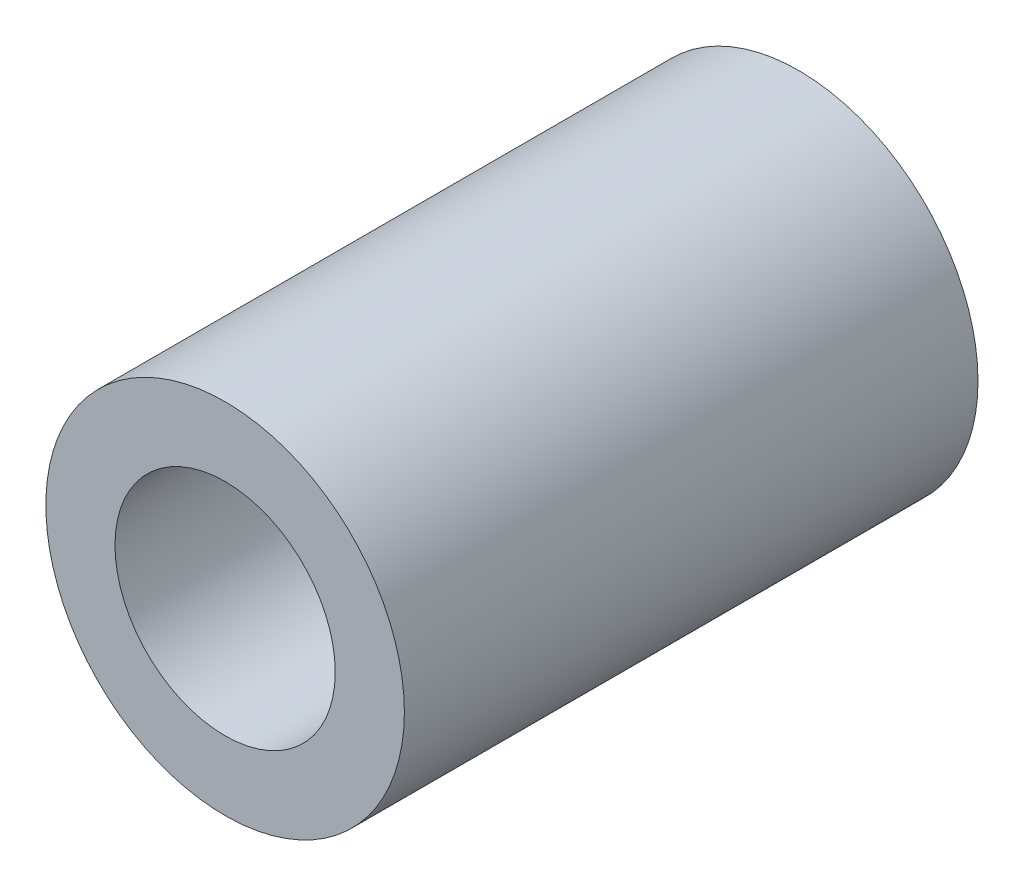
ISO-10303-21;
HEADER;
FILE_DESCRIPTION(('STEP AP214'),'2;1');
FILE_NAME('part.step','',(''),(''),'','','');
FILE_SCHEMA(('AUTOMOTIVE_DESIGN { 1 0 10303 214 1 1 1 1 }'));
ENDSEC;
DATA;
#1=APPLICATION_CONTEXT('core data for automotive mechanical design processes');
#2=APPLICATION_PROTOCOL_DEFINITION('international standard','automotive_design',2000,#1);
#3=PRODUCT_CONTEXT('',#1,'mechanical');
#4=PRODUCT('Part','Part','',(#3));
#5=PRODUCT_RELATED_PRODUCT_CATEGORY('part','',(#4));
#6=PRODUCT_DEFINITION_FORMATION('','',#4);
#7=PRODUCT_DEFINITION_CONTEXT('part definition',#1,'design');
#8=PRODUCT_DEFINITION('design','',#6,#7);
#9=PRODUCT_DEFINITION_SHAPE('','',#8);
#10=(LENGTH_UNIT() NAMED_UNIT(*) SI_UNIT(.MILLI.,.METRE.));
#11=(NAMED_UNIT(*) PLANE_ANGLE_UNIT() SI_UNIT($,.RADIAN.));
#12=(NAMED_UNIT(*) SI_UNIT($,.STERADIAN.) SOLID_ANGLE_UNIT());
#13=UNCERTAINTY_MEASURE_WITH_UNIT(LENGTH_MEASURE(1.E-05),#10,'distance_accuracy_value','');
#14=(GEOMETRIC_REPRESENTATION_CONTEXT(3) GLOBAL_UNCERTAINTY_ASSIGNED_CONTEXT((#13)) GLOBAL_UNIT_ASSIGNED_CONTEXT((#10,
#11,#12)) REPRESENTATION_CONTEXT('',''));
#15=CARTESIAN_POINT('',(0.,0.,0.));
#16=DIRECTION('',(0.,0.,1.));
#17=DIRECTION('',(1.,0.,0.));
#18=AXIS2_PLACEMENT_3D('',#15,#16,#17);
#19=CARTESIAN_POINT('',(0.,0.,6.35));
#20=DIRECTION('',(0.,0.,1.));
#21=DIRECTION('',(1.,0.,0.));
#22=AXIS2_PLACEMENT_3D('',#19,#20,#21);
#23=PLANE('',#22);
#24=CARTESIAN_POINT('',(0.,0.,6.35));
#25=DIRECTION('',(0.,0.,1.));
#26=DIRECTION('',(1.,0.,0.));
#27=AXIS2_PLACEMENT_3D('',#24,#25,#26);
#28=CIRCLE('',#27,3.96875);
#29=CARTESIAN_POINT('',(3.96875,0.,6.35));
#30=VERTEX_POINT('',#29);
#31=EDGE_CURVE('E10',#30,#30,#28,.T.);
#32=ORIENTED_EDGE('',*,*,#31,.T.);
#33=EDGE_LOOP('',(#32));
#34=FACE_BOUND('',#33,.T.);
#35=CARTESIAN_POINT('',(0.,0.,6.35));
#36=DIRECTION('',(0.,0.,1.));
#37=DIRECTION('',(1.,0.,0.));
#38=AXIS2_PLACEMENT_3D('',#35,#36,#37);
#39=CIRCLE('',#38,2.4384);
#40=CARTESIAN_POINT('',(2.4384,0.,6.35));
#41=VERTEX_POINT('',#40);
#42=EDGE_CURVE('E41',#41,#41,#39,.T.);
#43=ORIENTED_EDGE('',*,*,#42,.F.);
#44=EDGE_LOOP('',(#43));
#45=FACE_BOUND('',#44,.T.);
#46=ADVANCED_FACE('F34',(#34,#45),#23,.T.);
#47=CARTESIAN_POINT('',(0.,0.,6.35));
#48=DIRECTION('',(0.,0.,-1.));
#49=DIRECTION('',(-1.,0.,0.));
#50=AXIS2_PLACEMENT_3D('',#47,#48,#49);
#51=CYLINDRICAL_SURFACE('',#50,3.96875);
#52=ORIENTED_EDGE('',*,*,#31,.F.);
#53=EDGE_LOOP('',(#52));
#54=FACE_BOUND('',#53,.T.);
#55=CARTESIAN_POINT('',(0.,0.,-6.35));
#56=DIRECTION('',(0.,0.,1.));
#57=DIRECTION('',(1.,0.,0.));
#58=AXIS2_PLACEMENT_3D('',#55,#56,#57);
#59=CIRCLE('',#58,3.96875);
#60=CARTESIAN_POINT('',(3.96875,0.,-6.35));
#61=VERTEX_POINT('',#60);
#62=EDGE_CURVE('E45',#61,#61,#59,.T.);
#63=ORIENTED_EDGE('',*,*,#62,.T.);
#64=EDGE_LOOP('',(#63));
#65=FACE_BOUND('',#64,.T.);
#66=ADVANCED_FACE('F36',(#54,#65),#51,.T.);
#67=CARTESIAN_POINT('',(0.,0.,6.35));
#68=DIRECTION('',(0.,0.,-1.));
#69=DIRECTION('',(-1.,0.,0.));
#70=AXIS2_PLACEMENT_3D('',#67,#68,#69);
#71=CYLINDRICAL_SURFACE('',#70,2.4384);
#72=ORIENTED_EDGE('',*,*,#42,.T.);
#73=EDGE_LOOP('',(#72));
#74=FACE_BOUND('',#73,.T.);
#75=CARTESIAN_POINT('',(0.,0.,-6.35));
#76=DIRECTION('',(0.,0.,1.));
#77=DIRECTION('',(1.,0.,0.));
#78=AXIS2_PLACEMENT_3D('',#75,#76,#77);
#79=CIRCLE('',#78,2.4384);
#80=CARTESIAN_POINT('',(2.4384,0.,-6.35));
#81=VERTEX_POINT('',#80);
#82=EDGE_CURVE('E49',#81,#81,#79,.T.);
#83=ORIENTED_EDGE('',*,*,#82,.F.);
#84=EDGE_LOOP('',(#83));
#85=FACE_BOUND('',#84,.T.);
#86=ADVANCED_FACE('F58',(#74,#85),#71,.F.);
#87=CARTESIAN_POINT('',(0.,0.,-6.35));
#88=DIRECTION('',(0.,0.,1.));
#89=DIRECTION('',(1.,0.,0.));
#90=AXIS2_PLACEMENT_3D('',#87,#88,#89);
#91=PLANE('',#90);
#92=ORIENTED_EDGE('',*,*,#82,.T.);
#93=EDGE_LOOP('',(#92));
#94=FACE_BOUND('',#93,.T.);
#95=ORIENTED_EDGE('',*,*,#62,.F.);
#96=EDGE_LOOP('',(#95));
#97=FACE_BOUND('',#96,.T.);
#98=ADVANCED_FACE('F55',(#94,#97),#91,.F.);
#99=CLOSED_SHELL('',(#46,#66,#86,#98));
#100=MANIFOLD_SOLID_BREP('B2',#99);
#101=ADVANCED_BREP_SHAPE_REPRESENTATION('',(#18,#100),#14);
#102=SHAPE_DEFINITION_REPRESENTATION(#9,#101);
ENDSEC;
END-ISO-10303-21;
